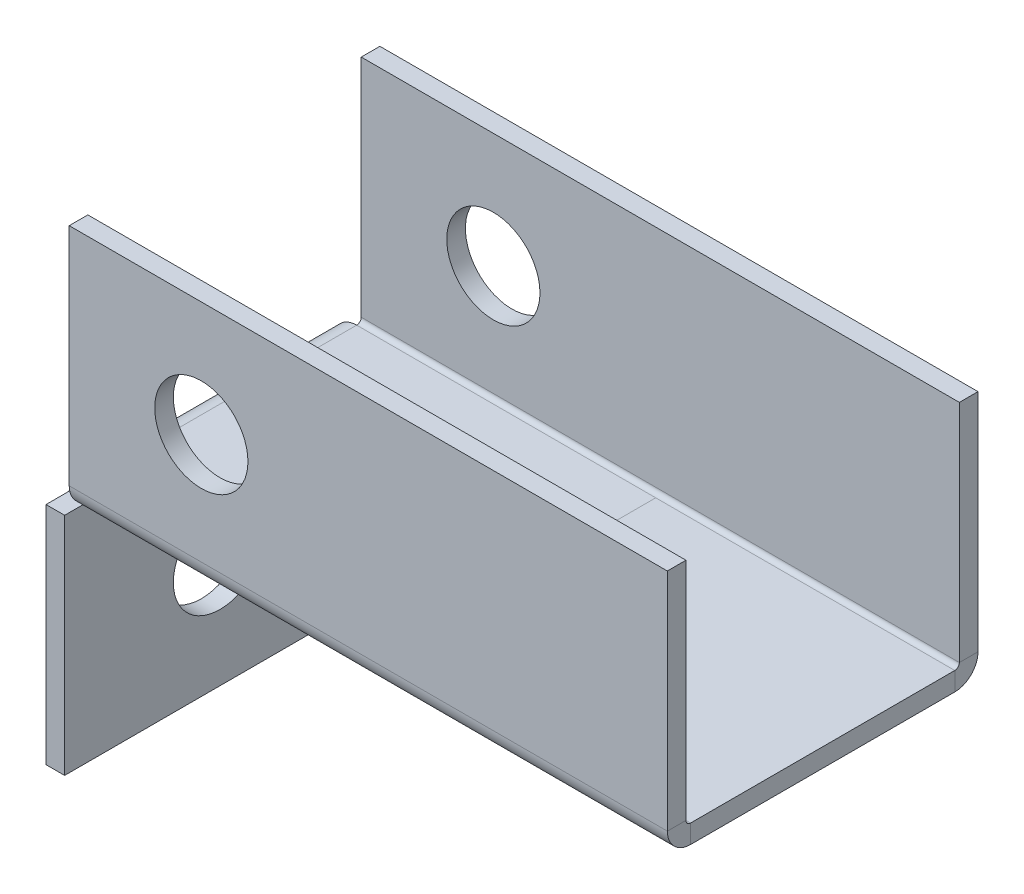
ISO-10303-21;
HEADER;
FILE_DESCRIPTION(('STEP AP214'),'2;1');
FILE_NAME('part.step','',(''),(''),'','','');
FILE_SCHEMA(('AUTOMOTIVE_DESIGN { 1 0 10303 214 1 1 1 1 }'));
ENDSEC;
DATA;
#1=APPLICATION_CONTEXT('core data for automotive mechanical design processes');
#2=APPLICATION_PROTOCOL_DEFINITION('international standard','automotive_design',2000,#1);
#3=PRODUCT_CONTEXT('',#1,'mechanical');
#4=PRODUCT('Part','Part','',(#3));
#5=PRODUCT_RELATED_PRODUCT_CATEGORY('part','',(#4));
#6=PRODUCT_DEFINITION_FORMATION('','',#4);
#7=PRODUCT_DEFINITION_CONTEXT('part definition',#1,'design');
#8=PRODUCT_DEFINITION('design','',#6,#7);
#9=PRODUCT_DEFINITION_SHAPE('','',#8);
#10=(LENGTH_UNIT() NAMED_UNIT(*) SI_UNIT(.MILLI.,.METRE.));
#11=(NAMED_UNIT(*) PLANE_ANGLE_UNIT() SI_UNIT($,.RADIAN.));
#12=(NAMED_UNIT(*) SI_UNIT($,.STERADIAN.) SOLID_ANGLE_UNIT());
#13=UNCERTAINTY_MEASURE_WITH_UNIT(LENGTH_MEASURE(1.E-05),#10,'distance_accuracy_value','');
#14=(GEOMETRIC_REPRESENTATION_CONTEXT(3) GLOBAL_UNCERTAINTY_ASSIGNED_CONTEXT((#13)) GLOBAL_UNIT_ASSIGNED_CONTEXT((#10,
#11,#12)) REPRESENTATION_CONTEXT('',''));
#15=CARTESIAN_POINT('',(0.,0.,0.));
#16=DIRECTION('',(0.,0.,1.));
#17=DIRECTION('',(1.,0.,0.));
#18=AXIS2_PLACEMENT_3D('',#15,#16,#17);
#19=CARTESIAN_POINT('',(0.,0.,0.));
#20=DIRECTION('',(0.,-1.,0.));
#21=DIRECTION('',(0.,0.,-1.));
#22=AXIS2_PLACEMENT_3D('',#19,#20,#21);
#23=PLANE('',#22);
#24=DIRECTION('',(0.,0.,1.));
#25=VECTOR('',#24,1.);
#26=CARTESIAN_POINT('',(1.8683,0.,0.));
#27=LINE('',#26,#25);
#28=CARTESIAN_POINT('',(1.8683,0.,-21.2634));
#29=VERTEX_POINT('',#28);
#30=CARTESIAN_POINT('',(1.8683,0.,21.2634));
#31=VERTEX_POINT('',#30);
#32=EDGE_CURVE('E14',#29,#31,#27,.T.);
#33=ORIENTED_EDGE('',*,*,#32,.F.);
#34=DIRECTION('',(-1.,0.,0.));
#35=VECTOR('',#34,1.);
#36=CARTESIAN_POINT('',(-46.2634,0.,-21.2634));
#37=LINE('',#36,#35);
#38=CARTESIAN_POINT('',(-46.2634,0.,-21.2634));
#39=VERTEX_POINT('',#38);
#40=EDGE_CURVE('E358',#39,#29,#37,.F.);
#41=ORIENTED_EDGE('',*,*,#40,.F.);
#42=DIRECTION('',(0.,0.,-1.));
#43=VECTOR('',#42,1.);
#44=CARTESIAN_POINT('',(-46.2634,0.,-25.));
#45=LINE('',#44,#43);
#46=CARTESIAN_POINT('',(-46.2634,0.,21.2634));
#47=VERTEX_POINT('',#46);
#48=EDGE_CURVE('E540',#39,#47,#45,.F.);
#49=ORIENTED_EDGE('',*,*,#48,.T.);
#50=DIRECTION('',(1.,0.,0.));
#51=VECTOR('',#50,1.);
#52=CARTESIAN_POINT('',(50.,0.,21.2634));
#53=LINE('',#52,#51);
#54=EDGE_CURVE('E438',#31,#47,#53,.F.);
#55=ORIENTED_EDGE('',*,*,#54,.F.);
#56=EDGE_LOOP('',(#33,#41,#49,#55));
#57=FACE_BOUND('',#56,.T.);
#58=ADVANCED_FACE('F122',(#57),#23,.F.);
#59=CARTESIAN_POINT('',(0.,-3.73660000000017,0.));
#60=DIRECTION('',(0.,-1.,0.));
#61=DIRECTION('',(1.,0.,0.));
#62=AXIS2_PLACEMENT_3D('',#59,#60,#61);
#63=PLANE('',#62);
#64=DIRECTION('',(-1.,0.,0.));
#65=VECTOR('',#64,1.);
#66=CARTESIAN_POINT('',(-47.,-3.7366,-21.2634));
#67=LINE('',#66,#65);
#68=CARTESIAN_POINT('',(-47.,-3.7366,-21.2634));
#69=VERTEX_POINT('',#68);
#70=CARTESIAN_POINT('',(-50.,-3.73659999999999,-21.2634));
#71=VERTEX_POINT('',#70);
#72=EDGE_CURVE('E130',#69,#71,#67,.T.);
#73=ORIENTED_EDGE('',*,*,#72,.F.);
#74=DIRECTION('',(0.,0.,-1.));
#75=VECTOR('',#74,1.);
#76=CARTESIAN_POINT('',(-47.,-3.7366,25.));
#77=LINE('',#76,#75);
#78=CARTESIAN_POINT('',(-47.,-3.7366,-25.));
#79=VERTEX_POINT('',#78);
#80=EDGE_CURVE('E933',#69,#79,#77,.T.);
#81=ORIENTED_EDGE('',*,*,#80,.T.);
#82=DIRECTION('',(1.,0.,0.));
#83=VECTOR('',#82,1.);
#84=CARTESIAN_POINT('',(-47.,-3.7366,-25.));
#85=LINE('',#84,#83);
#86=CARTESIAN_POINT('',(-50.,-3.73659999999999,-25.));
#87=VERTEX_POINT('',#86);
#88=EDGE_CURVE('E919',#79,#87,#85,.F.);
#89=ORIENTED_EDGE('',*,*,#88,.T.);
#90=DIRECTION('',(0.,0.,-1.));
#91=VECTOR('',#90,1.);
#92=CARTESIAN_POINT('',(-50.,-3.73659999999999,25.));
#93=LINE('',#92,#91);
#94=EDGE_CURVE('E938',#87,#71,#93,.F.);
#95=ORIENTED_EDGE('',*,*,#94,.T.);
#96=EDGE_LOOP('',(#73,#81,#89,#95));
#97=FACE_BOUND('',#96,.T.);
#98=ADVANCED_FACE('F124',(#97),#63,.F.);
#99=CARTESIAN_POINT('',(-46.2634,-3.7366,-25.));
#100=DIRECTION('',(0.,0.,-1.));
#101=DIRECTION('',(-1.,0.,0.));
#102=AXIS2_PLACEMENT_3D('',#99,#100,#101);
#103=CYLINDRICAL_SURFACE('',#102,3.73659999999999);
#104=ORIENTED_EDGE('',*,*,#48,.F.);
#105=CARTESIAN_POINT('',(-46.2634,-3.7366,-21.2634));
#106=DIRECTION('',(0.,0.,-1.));
#107=DIRECTION('',(0.,1.,0.));
#108=AXIS2_PLACEMENT_3D('',#105,#106,#107);
#109=CIRCLE('',#108,3.73659999999999);
#110=EDGE_CURVE('E544',#39,#71,#109,.F.);
#111=ORIENTED_EDGE('',*,*,#110,.T.);
#112=CARTESIAN_POINT('',(-50.,-3.73659999999999,21.2634));
#113=VERTEX_POINT('',#112);
#114=EDGE_CURVE('E944',#71,#113,#93,.F.);
#115=ORIENTED_EDGE('',*,*,#114,.T.);
#116=CARTESIAN_POINT('',(-46.2634,-3.7366,21.2634));
#117=DIRECTION('',(0.,0.,1.));
#118=DIRECTION('',(0.,-1.,0.));
#119=AXIS2_PLACEMENT_3D('',#116,#117,#118);
#120=CIRCLE('',#119,3.73659999999999);
#121=EDGE_CURVE('E547',#113,#47,#120,.F.);
#122=ORIENTED_EDGE('',*,*,#121,.T.);
#123=EDGE_LOOP('',(#104,#111,#115,#122));
#124=FACE_BOUND('',#123,.T.);
#125=ADVANCED_FACE('F519',(#124),#103,.T.);
#126=CARTESIAN_POINT('',(-46.2634,-3.7366,-21.2634));
#127=DIRECTION('',(0.,0.,-1.));
#128=DIRECTION('',(0.,1.,0.));
#129=AXIS2_PLACEMENT_3D('',#126,#127,#128);
#130=PLANE('',#129);
#131=CARTESIAN_POINT('',(-46.2634,-3.7366,-21.2634));
#132=DIRECTION('',(0.,0.,-1.));
#133=DIRECTION('',(0.,1.,0.));
#134=AXIS2_PLACEMENT_3D('',#131,#132,#133);
#135=CIRCLE('',#134,0.73659999999999);
#136=CARTESIAN_POINT('',(-46.2634,-3.00000000000002,-21.2634));
#137=VERTEX_POINT('',#136);
#138=EDGE_CURVE('E572',#137,#69,#135,.F.);
#139=ORIENTED_EDGE('',*,*,#138,.T.);
#140=ORIENTED_EDGE('',*,*,#72,.T.);
#141=ORIENTED_EDGE('',*,*,#110,.F.);
#142=DIRECTION('',(0.,-1.,0.));
#143=VECTOR('',#142,1.);
#144=CARTESIAN_POINT('',(-46.2634,0.,-21.2634));
#145=LINE('',#144,#143);
#146=EDGE_CURVE('E350',#39,#137,#145,.T.);
#147=ORIENTED_EDGE('',*,*,#146,.T.);
#148=EDGE_LOOP('',(#139,#140,#141,#147));
#149=FACE_BOUND('',#148,.T.);
#150=ADVANCED_FACE('F532',(#149),#130,.T.);
#151=CARTESIAN_POINT('',(0.,-3.,0.));
#152=DIRECTION('',(0.,-1.,0.));
#153=DIRECTION('',(0.,0.,-1.));
#154=AXIS2_PLACEMENT_3D('',#151,#152,#153);
#155=PLANE('',#154);
#156=DIRECTION('',(0.,0.,-1.));
#157=VECTOR('',#156,1.);
#158=CARTESIAN_POINT('',(-46.2634,-3.00000000000001,-25.));
#159=LINE('',#158,#157);
#160=CARTESIAN_POINT('',(-46.2634,-3.00000000000001,21.2634));
#161=VERTEX_POINT('',#160);
#162=EDGE_CURVE('E454',#137,#161,#159,.F.);
#163=ORIENTED_EDGE('',*,*,#162,.F.);
#164=DIRECTION('',(-1.,0.,0.));
#165=VECTOR('',#164,1.);
#166=CARTESIAN_POINT('',(-46.2634,-3.00000000000002,-21.2634));
#167=LINE('',#166,#165);
#168=CARTESIAN_POINT('',(50.,-3.,-21.2634));
#169=VERTEX_POINT('',#168);
#170=EDGE_CURVE('E341',#137,#169,#167,.F.);
#171=ORIENTED_EDGE('',*,*,#170,.T.);
#172=DIRECTION('',(0.,0.,-1.));
#173=VECTOR('',#172,1.);
#174=CARTESIAN_POINT('',(50.,-3.,-25.));
#175=LINE('',#174,#173);
#176=CARTESIAN_POINT('',(50.,-3.,21.2634));
#177=VERTEX_POINT('',#176);
#178=EDGE_CURVE('E553',#177,#169,#175,.T.);
#179=ORIENTED_EDGE('',*,*,#178,.F.);
#180=DIRECTION('',(1.,0.,0.));
#181=VECTOR('',#180,1.);
#182=CARTESIAN_POINT('',(50.,-3.,21.2634));
#183=LINE('',#182,#181);
#184=EDGE_CURVE('E417',#177,#161,#183,.F.);
#185=ORIENTED_EDGE('',*,*,#184,.T.);
#186=EDGE_LOOP('',(#163,#171,#179,#185));
#187=FACE_BOUND('',#186,.T.);
#188=ADVANCED_FACE('F525',(#187),#155,.T.);
#189=CARTESIAN_POINT('',(50.,0.,-21.2634));
#190=VERTEX_POINT('',#189);
#191=EDGE_CURVE('E362',#29,#190,#37,.F.);
#192=ORIENTED_EDGE('',*,*,#191,.F.);
#193=ORIENTED_EDGE('',*,*,#32,.T.);
#194=CARTESIAN_POINT('',(50.,0.,21.2634));
#195=VERTEX_POINT('',#194);
#196=EDGE_CURVE('E434',#195,#31,#53,.F.);
#197=ORIENTED_EDGE('',*,*,#196,.F.);
#198=DIRECTION('',(0.,0.,-1.));
#199=VECTOR('',#198,1.);
#200=CARTESIAN_POINT('',(50.,0.,-25.));
#201=LINE('',#200,#199);
#202=EDGE_CURVE('E536',#195,#190,#201,.T.);
#203=ORIENTED_EDGE('',*,*,#202,.T.);
#204=EDGE_LOOP('',(#192,#193,#197,#203));
#205=FACE_BOUND('',#204,.T.);
#206=ADVANCED_FACE('F515',(#205),#23,.F.);
#207=CARTESIAN_POINT('',(0.,-3.73660000000017,0.));
#208=DIRECTION('',(0.,1.,0.));
#209=DIRECTION('',(-1.,0.,0.));
#210=AXIS2_PLACEMENT_3D('',#207,#208,#209);
#211=PLANE('',#210);
#212=DIRECTION('',(1.,0.,0.));
#213=VECTOR('',#212,1.);
#214=CARTESIAN_POINT('',(-50.,-3.73659999999999,21.2634));
#215=LINE('',#214,#213);
#216=CARTESIAN_POINT('',(-47.,-3.7366,21.2634));
#217=VERTEX_POINT('',#216);
#218=EDGE_CURVE('E569',#113,#217,#215,.T.);
#219=ORIENTED_EDGE('',*,*,#218,.F.);
#220=CARTESIAN_POINT('',(-50.,-3.73659999999999,25.));
#221=VERTEX_POINT('',#220);
#222=EDGE_CURVE('E927',#113,#221,#93,.F.);
#223=ORIENTED_EDGE('',*,*,#222,.T.);
#224=DIRECTION('',(1.,0.,0.));
#225=VECTOR('',#224,1.);
#226=CARTESIAN_POINT('',(-50.,-3.73659999999999,25.));
#227=LINE('',#226,#225);
#228=CARTESIAN_POINT('',(-47.,-3.7366,25.));
#229=VERTEX_POINT('',#228);
#230=EDGE_CURVE('E446',#229,#221,#227,.F.);
#231=ORIENTED_EDGE('',*,*,#230,.F.);
#232=EDGE_CURVE('E928',#229,#217,#77,.T.);
#233=ORIENTED_EDGE('',*,*,#232,.T.);
#234=EDGE_LOOP('',(#219,#223,#231,#233));
#235=FACE_BOUND('',#234,.T.);
#236=ADVANCED_FACE('F524',(#235),#211,.T.);
#237=CARTESIAN_POINT('',(50.,-3.,-25.));
#238=DIRECTION('',(1.,0.,0.));
#239=DIRECTION('',(0.,0.,-1.));
#240=AXIS2_PLACEMENT_3D('',#237,#238,#239);
#241=PLANE('',#240);
#242=DIRECTION('',(0.,-1.,0.));
#243=VECTOR('',#242,1.);
#244=CARTESIAN_POINT('',(50.,0.,-21.2634));
#245=LINE('',#244,#243);
#246=EDGE_CURVE('E367',#190,#169,#245,.T.);
#247=ORIENTED_EDGE('',*,*,#246,.F.);
#248=ORIENTED_EDGE('',*,*,#202,.F.);
#249=DIRECTION('',(0.,-1.,0.));
#250=VECTOR('',#249,1.);
#251=CARTESIAN_POINT('',(50.,0.,21.2634));
#252=LINE('',#251,#250);
#253=EDGE_CURVE('E426',#195,#177,#252,.T.);
#254=ORIENTED_EDGE('',*,*,#253,.T.);
#255=ORIENTED_EDGE('',*,*,#178,.T.);
#256=EDGE_LOOP('',(#247,#248,#254,#255));
#257=FACE_BOUND('',#256,.T.);
#258=ADVANCED_FACE('F529',(#257),#241,.T.);
#259=CARTESIAN_POINT('',(-46.2634,-3.7366,21.2634));
#260=DIRECTION('',(0.,0.,1.));
#261=DIRECTION('',(0.,-1.,0.));
#262=AXIS2_PLACEMENT_3D('',#259,#260,#261);
#263=PLANE('',#262);
#264=ORIENTED_EDGE('',*,*,#121,.F.);
#265=ORIENTED_EDGE('',*,*,#218,.T.);
#266=CARTESIAN_POINT('',(-46.2634,-3.7366,21.2634));
#267=DIRECTION('',(0.,0.,1.));
#268=DIRECTION('',(0.,-1.,0.));
#269=AXIS2_PLACEMENT_3D('',#266,#267,#268);
#270=CIRCLE('',#269,0.73659999999999);
#271=EDGE_CURVE('E565',#217,#161,#270,.F.);
#272=ORIENTED_EDGE('',*,*,#271,.T.);
#273=DIRECTION('',(0.,-1.,0.));
#274=VECTOR('',#273,1.);
#275=CARTESIAN_POINT('',(-46.2634,0.,21.2634));
#276=LINE('',#275,#274);
#277=EDGE_CURVE('E442',#47,#161,#276,.T.);
#278=ORIENTED_EDGE('',*,*,#277,.F.);
#279=EDGE_LOOP('',(#264,#265,#272,#278));
#280=FACE_BOUND('',#279,.T.);
#281=ADVANCED_FACE('F628',(#280),#263,.T.);
#282=CARTESIAN_POINT('',(-46.2634,-3.7366,-25.));
#283=DIRECTION('',(0.,0.,-1.));
#284=DIRECTION('',(-1.,0.,0.));
#285=AXIS2_PLACEMENT_3D('',#282,#283,#284);
#286=CYLINDRICAL_SURFACE('',#285,0.73659999999999);
#287=ORIENTED_EDGE('',*,*,#138,.F.);
#288=ORIENTED_EDGE('',*,*,#162,.T.);
#289=ORIENTED_EDGE('',*,*,#271,.F.);
#290=EDGE_CURVE('E948',#217,#69,#77,.T.);
#291=ORIENTED_EDGE('',*,*,#290,.T.);
#292=EDGE_LOOP('',(#287,#288,#289,#291));
#293=FACE_BOUND('',#292,.T.);
#294=ADVANCED_FACE('F668',(#293),#286,.F.);
#295=CARTESIAN_POINT('',(-50.0000000000001,-40.,-25.));
#296=DIRECTION('',(0.,0.,1.));
#297=DIRECTION('',(1.,0.,0.));
#298=AXIS2_PLACEMENT_3D('',#295,#296,#297);
#299=PLANE('',#298);
#300=ORIENTED_EDGE('',*,*,#88,.F.);
#301=DIRECTION('',(0.,1.,0.));
#302=VECTOR('',#301,1.);
#303=CARTESIAN_POINT('',(-47.0000000000001,-40.,-25.));
#304=LINE('',#303,#302);
#305=CARTESIAN_POINT('',(-47.0000000000001,-40.,-25.));
#306=VERTEX_POINT('',#305);
#307=EDGE_CURVE('E922',#79,#306,#304,.F.);
#308=ORIENTED_EDGE('',*,*,#307,.T.);
#309=DIRECTION('',(1.,0.,0.));
#310=VECTOR('',#309,1.);
#311=CARTESIAN_POINT('',(-50.0000000000001,-40.,-25.));
#312=LINE('',#311,#310);
#313=CARTESIAN_POINT('',(-50.0000000000001,-40.,-25.));
#314=VERTEX_POINT('',#313);
#315=EDGE_CURVE('E450',#314,#306,#312,.T.);
#316=ORIENTED_EDGE('',*,*,#315,.F.);
#317=DIRECTION('',(0.,-1.,0.));
#318=VECTOR('',#317,1.);
#319=CARTESIAN_POINT('',(-50.,1.90979454354656E-13,-25.));
#320=LINE('',#319,#318);
#321=EDGE_CURVE('E467',#87,#314,#320,.T.);
#322=ORIENTED_EDGE('',*,*,#321,.F.);
#323=EDGE_LOOP('',(#300,#308,#316,#322));
#324=FACE_BOUND('',#323,.T.);
#325=ADVANCED_FACE('F736',(#324),#299,.F.);
#326=CARTESIAN_POINT('',(-50.,-2.99999999999999,25.));
#327=DIRECTION('',(0.,0.,-1.));
#328=DIRECTION('',(-1.,0.,0.));
#329=AXIS2_PLACEMENT_3D('',#326,#327,#328);
#330=PLANE('',#329);
#331=ORIENTED_EDGE('',*,*,#230,.T.);
#332=DIRECTION('',(0.,1.,0.));
#333=VECTOR('',#332,1.);
#334=CARTESIAN_POINT('',(-50.,1.86291012527692E-13,25.));
#335=LINE('',#334,#333);
#336=CARTESIAN_POINT('',(-50.0000000000001,-40.,25.));
#337=VERTEX_POINT('',#336);
#338=EDGE_CURVE('E459',#337,#221,#335,.T.);
#339=ORIENTED_EDGE('',*,*,#338,.F.);
#340=DIRECTION('',(1.,0.,0.));
#341=VECTOR('',#340,1.);
#342=CARTESIAN_POINT('',(-50.0000000000001,-40.,25.));
#343=LINE('',#342,#341);
#344=CARTESIAN_POINT('',(-47.0000000000001,-40.,25.));
#345=VERTEX_POINT('',#344);
#346=EDGE_CURVE('E455',#337,#345,#343,.T.);
#347=ORIENTED_EDGE('',*,*,#346,.T.);
#348=DIRECTION('',(0.,-1.,0.));
#349=VECTOR('',#348,1.);
#350=CARTESIAN_POINT('',(-47.,-3.,25.));
#351=LINE('',#350,#349);
#352=EDGE_CURVE('E942',#345,#229,#351,.F.);
#353=ORIENTED_EDGE('',*,*,#352,.T.);
#354=EDGE_LOOP('',(#331,#339,#347,#353));
#355=FACE_BOUND('',#354,.T.);
#356=ADVANCED_FACE('F612',(#355),#330,.F.);
#357=CARTESIAN_POINT('',(-50.,1.88635233441174E-13,0.));
#358=DIRECTION('',(1.,0.,0.));
#359=DIRECTION('',(0.,1.,0.));
#360=AXIS2_PLACEMENT_3D('',#357,#358,#359);
#361=PLANE('',#360);
#362=CARTESIAN_POINT('',(-50.,-21.8683,0.));
#363=DIRECTION('',(-1.,0.,0.));
#364=DIRECTION('',(0.,-1.,0.));
#365=AXIS2_PLACEMENT_3D('',#362,#363,#364);
#366=CIRCLE('',#365,7.5);
#367=CARTESIAN_POINT('',(-50.0000000000001,-29.3683,0.));
#368=VERTEX_POINT('',#367);
#369=EDGE_CURVE('E481',#368,#368,#366,.T.);
#370=ORIENTED_EDGE('',*,*,#369,.F.);
#371=EDGE_LOOP('',(#370));
#372=FACE_BOUND('',#371,.T.);
#373=ORIENTED_EDGE('',*,*,#94,.F.);
#374=ORIENTED_EDGE('',*,*,#321,.T.);
#375=DIRECTION('',(0.,0.,1.));
#376=VECTOR('',#375,1.);
#377=CARTESIAN_POINT('',(-50.0000000000001,-40.,0.));
#378=LINE('',#377,#376);
#379=EDGE_CURVE('E463',#314,#337,#378,.T.);
#380=ORIENTED_EDGE('',*,*,#379,.T.);
#381=ORIENTED_EDGE('',*,*,#338,.T.);
#382=ORIENTED_EDGE('',*,*,#222,.F.);
#383=ORIENTED_EDGE('',*,*,#114,.F.);
#384=EDGE_LOOP('',(#373,#374,#380,#381,#382,#383));
#385=FACE_BOUND('',#384,.T.);
#386=ADVANCED_FACE('F608',(#372,#385),#361,.F.);
#387=CARTESIAN_POINT('',(-47.,1.78160789424645E-13,0.));
#388=DIRECTION('',(1.,0.,0.));
#389=DIRECTION('',(0.,1.,0.));
#390=AXIS2_PLACEMENT_3D('',#387,#388,#389);
#391=PLANE('',#390);
#392=CARTESIAN_POINT('',(-47.,-21.8683,0.));
#393=DIRECTION('',(1.,0.,0.));
#394=DIRECTION('',(0.,1.,0.));
#395=AXIS2_PLACEMENT_3D('',#392,#393,#394);
#396=CIRCLE('',#395,7.5);
#397=CARTESIAN_POINT('',(-47.,-14.3683,0.));
#398=VERTEX_POINT('',#397);
#399=EDGE_CURVE('E1015',#398,#398,#396,.F.);
#400=ORIENTED_EDGE('',*,*,#399,.T.);
#401=EDGE_LOOP('',(#400));
#402=FACE_BOUND('',#401,.T.);
#403=ORIENTED_EDGE('',*,*,#307,.F.);
#404=ORIENTED_EDGE('',*,*,#80,.F.);
#405=ORIENTED_EDGE('',*,*,#290,.F.);
#406=ORIENTED_EDGE('',*,*,#232,.F.);
#407=ORIENTED_EDGE('',*,*,#352,.F.);
#408=DIRECTION('',(0.,0.,-1.));
#409=VECTOR('',#408,1.);
#410=CARTESIAN_POINT('',(-47.0000000000001,-40.,25.));
#411=LINE('',#410,#409);
#412=EDGE_CURVE('E936',#306,#345,#411,.F.);
#413=ORIENTED_EDGE('',*,*,#412,.F.);
#414=EDGE_LOOP('',(#403,#404,#405,#406,#407,#413));
#415=FACE_BOUND('',#414,.T.);
#416=ADVANCED_FACE('F611',(#402,#415),#391,.T.);
#417=CARTESIAN_POINT('',(-50.0000000000001,-40.,25.));
#418=DIRECTION('',(0.,1.,0.));
#419=DIRECTION('',(-1.,0.,0.));
#420=AXIS2_PLACEMENT_3D('',#417,#418,#419);
#421=PLANE('',#420);
#422=ORIENTED_EDGE('',*,*,#412,.T.);
#423=ORIENTED_EDGE('',*,*,#346,.F.);
#424=ORIENTED_EDGE('',*,*,#379,.F.);
#425=ORIENTED_EDGE('',*,*,#315,.T.);
#426=EDGE_LOOP('',(#422,#423,#424,#425));
#427=FACE_BOUND('',#426,.T.);
#428=ADVANCED_FACE('F620',(#427),#421,.F.);
#429=CARTESIAN_POINT('',(-46.2634,0.736599999999997,21.2634));
#430=DIRECTION('',(-1.,0.,0.));
#431=DIRECTION('',(0.,0.,1.));
#432=AXIS2_PLACEMENT_3D('',#429,#430,#431);
#433=PLANE('',#432);
#434=DIRECTION('',(0.,0.,-1.));
#435=VECTOR('',#434,1.);
#436=CARTESIAN_POINT('',(-46.2634,0.736599999999997,25.));
#437=LINE('',#436,#435);
#438=CARTESIAN_POINT('',(-46.2634,0.736599999999997,22.));
#439=VERTEX_POINT('',#438);
#440=CARTESIAN_POINT('',(-46.2634,0.736599999999997,25.));
#441=VERTEX_POINT('',#440);
#442=EDGE_CURVE('E371',#439,#441,#437,.F.);
#443=ORIENTED_EDGE('',*,*,#442,.F.);
#444=CARTESIAN_POINT('',(-46.2634,0.736599999999997,21.2634));
#445=DIRECTION('',(1.,0.,0.));
#446=DIRECTION('',(0.,0.,-1.));
#447=AXIS2_PLACEMENT_3D('',#444,#445,#446);
#448=CIRCLE('',#447,0.7366);
#449=EDGE_CURVE('E430',#47,#439,#448,.F.);
#450=ORIENTED_EDGE('',*,*,#449,.F.);
#451=ORIENTED_EDGE('',*,*,#277,.T.);
#452=CARTESIAN_POINT('',(-46.2634,0.736599999999997,21.2634));
#453=DIRECTION('',(1.,0.,0.));
#454=DIRECTION('',(0.,0.,-1.));
#455=AXIS2_PLACEMENT_3D('',#452,#453,#454);
#456=CIRCLE('',#455,3.7366);
#457=EDGE_CURVE('E421',#161,#441,#456,.F.);
#458=ORIENTED_EDGE('',*,*,#457,.T.);
#459=EDGE_LOOP('',(#443,#450,#451,#458));
#460=FACE_BOUND('',#459,.T.);
#461=ADVANCED_FACE('F634',(#460),#433,.T.);
#462=CARTESIAN_POINT('',(50.,0.736599999999997,21.2634));
#463=DIRECTION('',(-1.,0.,0.));
#464=DIRECTION('',(0.,0.,1.));
#465=AXIS2_PLACEMENT_3D('',#462,#463,#464);
#466=PLANE('',#465);
#467=CARTESIAN_POINT('',(50.,0.736599999999997,21.2634));
#468=DIRECTION('',(1.,0.,0.));
#469=DIRECTION('',(0.,0.,-1.));
#470=AXIS2_PLACEMENT_3D('',#467,#468,#469);
#471=CIRCLE('',#470,0.7366);
#472=CARTESIAN_POINT('',(50.,0.736599999999997,22.));
#473=VERTEX_POINT('',#472);
#474=EDGE_CURVE('E379',#473,#195,#471,.T.);
#475=ORIENTED_EDGE('',*,*,#474,.F.);
#476=DIRECTION('',(0.,0.,-1.));
#477=VECTOR('',#476,1.);
#478=CARTESIAN_POINT('',(50.,0.736599999999997,22.));
#479=LINE('',#478,#477);
#480=CARTESIAN_POINT('',(50.,0.736599999999997,25.));
#481=VERTEX_POINT('',#480);
#482=EDGE_CURVE('E407',#473,#481,#479,.F.);
#483=ORIENTED_EDGE('',*,*,#482,.T.);
#484=CARTESIAN_POINT('',(50.,0.736599999999997,21.2634));
#485=DIRECTION('',(1.,0.,0.));
#486=DIRECTION('',(0.,0.,-1.));
#487=AXIS2_PLACEMENT_3D('',#484,#485,#486);
#488=CIRCLE('',#487,3.7366);
#489=EDGE_CURVE('E422',#481,#177,#488,.T.);
#490=ORIENTED_EDGE('',*,*,#489,.T.);
#491=ORIENTED_EDGE('',*,*,#253,.F.);
#492=EDGE_LOOP('',(#475,#483,#490,#491));
#493=FACE_BOUND('',#492,.T.);
#494=ADVANCED_FACE('F637',(#493),#466,.F.);
#495=CARTESIAN_POINT('',(50.,0.736599999999997,21.2634));
#496=DIRECTION('',(1.,0.,0.));
#497=DIRECTION('',(0.,0.,1.));
#498=AXIS2_PLACEMENT_3D('',#495,#496,#497);
#499=CYLINDRICAL_SURFACE('',#498,3.7366);
#500=ORIENTED_EDGE('',*,*,#184,.F.);
#501=ORIENTED_EDGE('',*,*,#489,.F.);
#502=DIRECTION('',(1.,0.,0.));
#503=VECTOR('',#502,1.);
#504=CARTESIAN_POINT('',(-46.2634,0.736599999999997,25.));
#505=LINE('',#504,#503);
#506=EDGE_CURVE('E404',#481,#441,#505,.F.);
#507=ORIENTED_EDGE('',*,*,#506,.T.);
#508=ORIENTED_EDGE('',*,*,#457,.F.);
#509=EDGE_LOOP('',(#500,#501,#507,#508));
#510=FACE_BOUND('',#509,.T.);
#511=ADVANCED_FACE('F645',(#510),#499,.T.);
#512=CARTESIAN_POINT('',(50.,0.736599999999997,21.2634));
#513=DIRECTION('',(1.,0.,0.));
#514=DIRECTION('',(0.,0.,1.));
#515=AXIS2_PLACEMENT_3D('',#512,#513,#514);
#516=CYLINDRICAL_SURFACE('',#515,0.7366);
#517=ORIENTED_EDGE('',*,*,#196,.T.);
#518=ORIENTED_EDGE('',*,*,#54,.T.);
#519=ORIENTED_EDGE('',*,*,#449,.T.);
#520=DIRECTION('',(1.,0.,0.));
#521=VECTOR('',#520,1.);
#522=CARTESIAN_POINT('',(-46.2634,0.736599999999997,22.));
#523=LINE('',#522,#521);
#524=EDGE_CURVE('E411',#439,#473,#523,.T.);
#525=ORIENTED_EDGE('',*,*,#524,.T.);
#526=ORIENTED_EDGE('',*,*,#474,.T.);
#527=EDGE_LOOP('',(#517,#518,#519,#525,#526));
#528=FACE_BOUND('',#527,.T.);
#529=ADVANCED_FACE('F697',(#528),#516,.F.);
#530=CARTESIAN_POINT('',(50.,37.,25.));
#531=DIRECTION('',(-1.,0.,0.));
#532=DIRECTION('',(0.,0.,1.));
#533=AXIS2_PLACEMENT_3D('',#530,#531,#532);
#534=PLANE('',#533);
#535=ORIENTED_EDGE('',*,*,#482,.F.);
#536=DIRECTION('',(0.,-1.,0.));
#537=VECTOR('',#536,1.);
#538=CARTESIAN_POINT('',(50.,37.,22.));
#539=LINE('',#538,#537);
#540=CARTESIAN_POINT('',(50.,37.,22.));
#541=VERTEX_POINT('',#540);
#542=EDGE_CURVE('E401',#473,#541,#539,.F.);
#543=ORIENTED_EDGE('',*,*,#542,.T.);
#544=DIRECTION('',(0.,0.,-1.));
#545=VECTOR('',#544,1.);
#546=CARTESIAN_POINT('',(50.,37.,25.));
#547=LINE('',#546,#545);
#548=CARTESIAN_POINT('',(50.,37.,25.));
#549=VERTEX_POINT('',#548);
#550=EDGE_CURVE('E375',#549,#541,#547,.T.);
#551=ORIENTED_EDGE('',*,*,#550,.F.);
#552=DIRECTION('',(0.,1.,0.));
#553=VECTOR('',#552,1.);
#554=CARTESIAN_POINT('',(50.,0.,25.));
#555=LINE('',#554,#553);
#556=EDGE_CURVE('E391',#481,#549,#555,.T.);
#557=ORIENTED_EDGE('',*,*,#556,.F.);
#558=EDGE_LOOP('',(#535,#543,#551,#557));
#559=FACE_BOUND('',#558,.T.);
#560=ADVANCED_FACE('F691',(#559),#534,.F.);
#561=CARTESIAN_POINT('',(-46.2634,0.,25.));
#562=DIRECTION('',(1.,0.,0.));
#563=DIRECTION('',(0.,0.,-1.));
#564=AXIS2_PLACEMENT_3D('',#561,#562,#563);
#565=PLANE('',#564);
#566=ORIENTED_EDGE('',*,*,#442,.T.);
#567=DIRECTION('',(0.,-1.,0.));
#568=VECTOR('',#567,1.);
#569=CARTESIAN_POINT('',(-46.2634,0.,25.));
#570=LINE('',#569,#568);
#571=CARTESIAN_POINT('',(-46.2634,37.,25.));
#572=VERTEX_POINT('',#571);
#573=EDGE_CURVE('E384',#572,#441,#570,.T.);
#574=ORIENTED_EDGE('',*,*,#573,.F.);
#575=DIRECTION('',(0.,0.,-1.));
#576=VECTOR('',#575,1.);
#577=CARTESIAN_POINT('',(-46.2634,37.,25.));
#578=LINE('',#577,#576);
#579=CARTESIAN_POINT('',(-46.2634,37.,22.));
#580=VERTEX_POINT('',#579);
#581=EDGE_CURVE('E380',#572,#580,#578,.T.);
#582=ORIENTED_EDGE('',*,*,#581,.T.);
#583=DIRECTION('',(0.,1.,0.));
#584=VECTOR('',#583,1.);
#585=CARTESIAN_POINT('',(-46.2634,0.,22.));
#586=LINE('',#585,#584);
#587=EDGE_CURVE('E394',#580,#439,#586,.F.);
#588=ORIENTED_EDGE('',*,*,#587,.T.);
#589=EDGE_LOOP('',(#566,#574,#582,#588));
#590=FACE_BOUND('',#589,.T.);
#591=ADVANCED_FACE('F689',(#590),#565,.F.);
#592=CARTESIAN_POINT('',(0.,0.,25.));
#593=DIRECTION('',(0.,0.,-1.));
#594=DIRECTION('',(-1.,0.,0.));
#595=AXIS2_PLACEMENT_3D('',#592,#593,#594);
#596=PLANE('',#595);
#597=CARTESIAN_POINT('',(-25.,18.5,25.));
#598=DIRECTION('',(0.,0.,1.));
#599=DIRECTION('',(1.,0.,0.));
#600=AXIS2_PLACEMENT_3D('',#597,#598,#599);
#601=CIRCLE('',#600,7.5);
#602=CARTESIAN_POINT('',(-17.5,18.5,25.));
#603=VERTEX_POINT('',#602);
#604=EDGE_CURVE('E475',#603,#603,#601,.T.);
#605=ORIENTED_EDGE('',*,*,#604,.F.);
#606=EDGE_LOOP('',(#605));
#607=FACE_BOUND('',#606,.T.);
#608=ORIENTED_EDGE('',*,*,#506,.F.);
#609=ORIENTED_EDGE('',*,*,#556,.T.);
#610=DIRECTION('',(-1.,0.,0.));
#611=VECTOR('',#610,1.);
#612=CARTESIAN_POINT('',(0.,37.,25.));
#613=LINE('',#612,#611);
#614=EDGE_CURVE('E388',#549,#572,#613,.T.);
#615=ORIENTED_EDGE('',*,*,#614,.T.);
#616=ORIENTED_EDGE('',*,*,#573,.T.);
#617=EDGE_LOOP('',(#608,#609,#615,#616));
#618=FACE_BOUND('',#617,.T.);
#619=ADVANCED_FACE('F690',(#607,#618),#596,.F.);
#620=CARTESIAN_POINT('',(0.,0.,22.));
#621=DIRECTION('',(0.,0.,-1.));
#622=DIRECTION('',(-1.,0.,0.));
#623=AXIS2_PLACEMENT_3D('',#620,#621,#622);
#624=PLANE('',#623);
#625=CARTESIAN_POINT('',(-25.,18.5,22.));
#626=DIRECTION('',(0.,0.,-1.));
#627=DIRECTION('',(-1.,0.,0.));
#628=AXIS2_PLACEMENT_3D('',#625,#626,#627);
#629=CIRCLE('',#628,7.5);
#630=CARTESIAN_POINT('',(-32.5,18.5,22.));
#631=VERTEX_POINT('',#630);
#632=EDGE_CURVE('E340',#631,#631,#629,.T.);
#633=ORIENTED_EDGE('',*,*,#632,.F.);
#634=EDGE_LOOP('',(#633));
#635=FACE_BOUND('',#634,.T.);
#636=ORIENTED_EDGE('',*,*,#542,.F.);
#637=ORIENTED_EDGE('',*,*,#524,.F.);
#638=ORIENTED_EDGE('',*,*,#587,.F.);
#639=DIRECTION('',(1.,0.,0.));
#640=VECTOR('',#639,1.);
#641=CARTESIAN_POINT('',(-46.2634,37.,22.));
#642=LINE('',#641,#640);
#643=EDGE_CURVE('E398',#541,#580,#642,.F.);
#644=ORIENTED_EDGE('',*,*,#643,.F.);
#645=EDGE_LOOP('',(#636,#637,#638,#644));
#646=FACE_BOUND('',#645,.T.);
#647=ADVANCED_FACE('F683',(#635,#646),#624,.T.);
#648=CARTESIAN_POINT('',(-46.2634,37.,25.));
#649=DIRECTION('',(0.,-1.,0.));
#650=DIRECTION('',(0.,0.,-1.));
#651=AXIS2_PLACEMENT_3D('',#648,#649,#650);
#652=PLANE('',#651);
#653=ORIENTED_EDGE('',*,*,#643,.T.);
#654=ORIENTED_EDGE('',*,*,#581,.F.);
#655=ORIENTED_EDGE('',*,*,#614,.F.);
#656=ORIENTED_EDGE('',*,*,#550,.T.);
#657=EDGE_LOOP('',(#653,#654,#655,#656));
#658=FACE_BOUND('',#657,.T.);
#659=ADVANCED_FACE('F654',(#658),#652,.F.);
#660=CARTESIAN_POINT('',(50.,0.736599999999994,-21.2634));
#661=DIRECTION('',(1.,0.,0.));
#662=DIRECTION('',(0.,1.,0.));
#663=AXIS2_PLACEMENT_3D('',#660,#661,#662);
#664=PLANE('',#663);
#665=DIRECTION('',(0.,0.,1.));
#666=VECTOR('',#665,1.);
#667=CARTESIAN_POINT('',(50.,0.736600000000018,-25.));
#668=LINE('',#667,#666);
#669=CARTESIAN_POINT('',(50.,0.736599999999991,-22.));
#670=VERTEX_POINT('',#669);
#671=CARTESIAN_POINT('',(50.,0.73659999999998,-25.));
#672=VERTEX_POINT('',#671);
#673=EDGE_CURVE('E314',#670,#672,#668,.F.);
#674=ORIENTED_EDGE('',*,*,#673,.F.);
#675=CARTESIAN_POINT('',(50.,0.736599999999994,-21.2634));
#676=DIRECTION('',(-1.,0.,0.));
#677=DIRECTION('',(0.,-1.,0.));
#678=AXIS2_PLACEMENT_3D('',#675,#676,#677);
#679=CIRCLE('',#678,0.736600000000004);
#680=EDGE_CURVE('E354',#190,#670,#679,.F.);
#681=ORIENTED_EDGE('',*,*,#680,.F.);
#682=ORIENTED_EDGE('',*,*,#246,.T.);
#683=CARTESIAN_POINT('',(50.,0.736599999999994,-21.2634));
#684=DIRECTION('',(-1.,0.,0.));
#685=DIRECTION('',(0.,-1.,0.));
#686=AXIS2_PLACEMENT_3D('',#683,#684,#685);
#687=CIRCLE('',#686,3.7366);
#688=EDGE_CURVE('E345',#169,#672,#687,.F.);
#689=ORIENTED_EDGE('',*,*,#688,.T.);
#690=EDGE_LOOP('',(#674,#681,#682,#689));
#691=FACE_BOUND('',#690,.T.);
#692=ADVANCED_FACE('F651',(#691),#664,.T.);
#693=CARTESIAN_POINT('',(-46.2634,0.736599999999987,-21.2634));
#694=DIRECTION('',(1.,0.,0.));
#695=DIRECTION('',(0.,1.,0.));
#696=AXIS2_PLACEMENT_3D('',#693,#694,#695);
#697=PLANE('',#696);
#698=CARTESIAN_POINT('',(-46.2634,0.736599999999987,-21.2634));
#699=DIRECTION('',(-1.,0.,0.));
#700=DIRECTION('',(0.,-1.,0.));
#701=AXIS2_PLACEMENT_3D('',#698,#699,#700);
#702=CIRCLE('',#701,0.736600000000004);
#703=CARTESIAN_POINT('',(-46.2634,0.736599999999984,-22.));
#704=VERTEX_POINT('',#703);
#705=EDGE_CURVE('E363',#704,#39,#702,.T.);
#706=ORIENTED_EDGE('',*,*,#705,.F.);
#707=DIRECTION('',(0.,0.,1.));
#708=VECTOR('',#707,1.);
#709=CARTESIAN_POINT('',(-46.2634,0.736599999999993,-22.));
#710=LINE('',#709,#708);
#711=CARTESIAN_POINT('',(-46.2634,0.736600000000014,-25.));
#712=VERTEX_POINT('',#711);
#713=EDGE_CURVE('E331',#704,#712,#710,.F.);
#714=ORIENTED_EDGE('',*,*,#713,.T.);
#715=CARTESIAN_POINT('',(-46.2634,0.736599999999987,-21.2634));
#716=DIRECTION('',(-1.,0.,0.));
#717=DIRECTION('',(0.,-1.,0.));
#718=AXIS2_PLACEMENT_3D('',#715,#716,#717);
#719=CIRCLE('',#718,3.7366);
#720=EDGE_CURVE('E346',#712,#137,#719,.T.);
#721=ORIENTED_EDGE('',*,*,#720,.T.);
#722=ORIENTED_EDGE('',*,*,#146,.F.);
#723=EDGE_LOOP('',(#706,#714,#721,#722));
#724=FACE_BOUND('',#723,.T.);
#725=ADVANCED_FACE('F501',(#724),#697,.F.);
#726=CARTESIAN_POINT('',(-46.2634,0.736599999999987,-21.2634));
#727=DIRECTION('',(-1.,0.,0.));
#728=DIRECTION('',(0.,0.,-1.));
#729=AXIS2_PLACEMENT_3D('',#726,#727,#728);
#730=CYLINDRICAL_SURFACE('',#729,3.7366);
#731=ORIENTED_EDGE('',*,*,#170,.F.);
#732=ORIENTED_EDGE('',*,*,#720,.F.);
#733=DIRECTION('',(-1.,0.,0.));
#734=VECTOR('',#733,1.);
#735=CARTESIAN_POINT('',(50.,0.736600000000018,-25.));
#736=LINE('',#735,#734);
#737=EDGE_CURVE('E328',#712,#672,#736,.F.);
#738=ORIENTED_EDGE('',*,*,#737,.T.);
#739=ORIENTED_EDGE('',*,*,#688,.F.);
#740=EDGE_LOOP('',(#731,#732,#738,#739));
#741=FACE_BOUND('',#740,.T.);
#742=ADVANCED_FACE('F662',(#741),#730,.T.);
#743=CARTESIAN_POINT('',(-46.2634,0.736599999999987,-21.2634));
#744=DIRECTION('',(-1.,0.,0.));
#745=DIRECTION('',(0.,0.,-1.));
#746=AXIS2_PLACEMENT_3D('',#743,#744,#745);
#747=CYLINDRICAL_SURFACE('',#746,0.736600000000004);
#748=ORIENTED_EDGE('',*,*,#40,.T.);
#749=ORIENTED_EDGE('',*,*,#191,.T.);
#750=ORIENTED_EDGE('',*,*,#680,.T.);
#751=DIRECTION('',(-1.,0.,0.));
#752=VECTOR('',#751,1.);
#753=CARTESIAN_POINT('',(50.,0.736599999999997,-22.));
#754=LINE('',#753,#752);
#755=EDGE_CURVE('E335',#670,#704,#754,.T.);
#756=ORIENTED_EDGE('',*,*,#755,.T.);
#757=ORIENTED_EDGE('',*,*,#705,.T.);
#758=EDGE_LOOP('',(#748,#749,#750,#756,#757));
#759=FACE_BOUND('',#758,.T.);
#760=ADVANCED_FACE('F496',(#759),#747,.F.);
#761=CARTESIAN_POINT('',(50.,0.,-25.));
#762=DIRECTION('',(-1.,0.,0.));
#763=DIRECTION('',(0.,-1.,0.));
#764=AXIS2_PLACEMENT_3D('',#761,#762,#763);
#765=PLANE('',#764);
#766=ORIENTED_EDGE('',*,*,#673,.T.);
#767=DIRECTION('',(0.,-1.,0.));
#768=VECTOR('',#767,1.);
#769=CARTESIAN_POINT('',(50.,0.,-25.));
#770=LINE('',#769,#768);
#771=CARTESIAN_POINT('',(50.,37.,-25.0000000000001));
#772=VERTEX_POINT('',#771);
#773=EDGE_CURVE('E293',#772,#672,#770,.T.);
#774=ORIENTED_EDGE('',*,*,#773,.F.);
#775=DIRECTION('',(0.,0.,1.));
#776=VECTOR('',#775,1.);
#777=CARTESIAN_POINT('',(50.,37.,-25.0000000000001));
#778=LINE('',#777,#776);
#779=CARTESIAN_POINT('',(50.,37.,-22.0000000000001));
#780=VERTEX_POINT('',#779);
#781=EDGE_CURVE('E300',#772,#780,#778,.T.);
#782=ORIENTED_EDGE('',*,*,#781,.T.);
#783=DIRECTION('',(0.,1.,0.));
#784=VECTOR('',#783,1.);
#785=CARTESIAN_POINT('',(50.,0.,-22.));
#786=LINE('',#785,#784);
#787=EDGE_CURVE('E325',#780,#670,#786,.F.);
#788=ORIENTED_EDGE('',*,*,#787,.T.);
#789=EDGE_LOOP('',(#766,#774,#782,#788));
#790=FACE_BOUND('',#789,.T.);
#791=ADVANCED_FACE('F313',(#790),#765,.F.);
#792=CARTESIAN_POINT('',(-46.2634,37.,-25.0000000000001));
#793=DIRECTION('',(1.,0.,0.));
#794=DIRECTION('',(0.,1.,0.));
#795=AXIS2_PLACEMENT_3D('',#792,#793,#794);
#796=PLANE('',#795);
#797=ORIENTED_EDGE('',*,*,#713,.F.);
#798=DIRECTION('',(0.,-1.,0.));
#799=VECTOR('',#798,1.);
#800=CARTESIAN_POINT('',(-46.2634,37.,-22.0000000000001));
#801=LINE('',#800,#799);
#802=CARTESIAN_POINT('',(-46.2634,37.,-22.0000000000001));
#803=VERTEX_POINT('',#802);
#804=EDGE_CURVE('E320',#704,#803,#801,.F.);
#805=ORIENTED_EDGE('',*,*,#804,.T.);
#806=DIRECTION('',(0.,0.,1.));
#807=VECTOR('',#806,1.);
#808=CARTESIAN_POINT('',(-46.2634,37.,-25.0000000000001));
#809=LINE('',#808,#807);
#810=CARTESIAN_POINT('',(-46.2634,37.,-25.0000000000001));
#811=VERTEX_POINT('',#810);
#812=EDGE_CURVE('E310',#811,#803,#809,.T.);
#813=ORIENTED_EDGE('',*,*,#812,.F.);
#814=DIRECTION('',(0.,1.,0.));
#815=VECTOR('',#814,1.);
#816=CARTESIAN_POINT('',(-46.2634,-1.05886748200073E-13,-25.));
#817=LINE('',#816,#815);
#818=EDGE_CURVE('E295',#712,#811,#817,.T.);
#819=ORIENTED_EDGE('',*,*,#818,.F.);
#820=EDGE_LOOP('',(#797,#805,#813,#819));
#821=FACE_BOUND('',#820,.T.);
#822=ADVANCED_FACE('F502',(#821),#796,.F.);
#823=CARTESIAN_POINT('',(0.,0.,-25.));
#824=DIRECTION('',(0.,0.,1.));
#825=DIRECTION('',(0.,-1.,0.));
#826=AXIS2_PLACEMENT_3D('',#823,#824,#825);
#827=PLANE('',#826);
#828=CARTESIAN_POINT('',(-25.,18.5,-25.0000000000001));
#829=DIRECTION('',(0.,0.,1.));
#830=DIRECTION('',(1.,0.,0.));
#831=AXIS2_PLACEMENT_3D('',#828,#829,#830);
#832=CIRCLE('',#831,7.5);
#833=CARTESIAN_POINT('',(-17.5,18.5,-25.0000000000001));
#834=VERTEX_POINT('',#833);
#835=EDGE_CURVE('E480',#834,#834,#832,.T.);
#836=ORIENTED_EDGE('',*,*,#835,.T.);
#837=EDGE_LOOP('',(#836));
#838=FACE_BOUND('',#837,.T.);
#839=ORIENTED_EDGE('',*,*,#737,.F.);
#840=ORIENTED_EDGE('',*,*,#818,.T.);
#841=DIRECTION('',(1.,0.,0.));
#842=VECTOR('',#841,1.);
#843=CARTESIAN_POINT('',(0.,37.,-25.0000000000001));
#844=LINE('',#843,#842);
#845=EDGE_CURVE('E288',#811,#772,#844,.T.);
#846=ORIENTED_EDGE('',*,*,#845,.T.);
#847=ORIENTED_EDGE('',*,*,#773,.T.);
#848=EDGE_LOOP('',(#839,#840,#846,#847));
#849=FACE_BOUND('',#848,.T.);
#850=ADVANCED_FACE('F291',(#838,#849),#827,.F.);
#851=CARTESIAN_POINT('',(0.,0.,-22.));
#852=DIRECTION('',(0.,0.,1.));
#853=DIRECTION('',(0.,-1.,0.));
#854=AXIS2_PLACEMENT_3D('',#851,#852,#853);
#855=PLANE('',#854);
#856=CARTESIAN_POINT('',(-25.,18.5,-22.0000000000001));
#857=DIRECTION('',(0.,0.,1.));
#858=DIRECTION('',(0.,-1.,0.));
#859=AXIS2_PLACEMENT_3D('',#856,#857,#858);
#860=CIRCLE('',#859,7.5);
#861=CARTESIAN_POINT('',(-25.,11.,-22.));
#862=VERTEX_POINT('',#861);
#863=EDGE_CURVE('E487',#862,#862,#860,.T.);
#864=ORIENTED_EDGE('',*,*,#863,.F.);
#865=EDGE_LOOP('',(#864));
#866=FACE_BOUND('',#865,.T.);
#867=ORIENTED_EDGE('',*,*,#804,.F.);
#868=ORIENTED_EDGE('',*,*,#755,.F.);
#869=ORIENTED_EDGE('',*,*,#787,.F.);
#870=DIRECTION('',(-1.,0.,0.));
#871=VECTOR('',#870,1.);
#872=CARTESIAN_POINT('',(50.,37.,-22.0000000000001));
#873=LINE('',#872,#871);
#874=EDGE_CURVE('E305',#803,#780,#873,.F.);
#875=ORIENTED_EDGE('',*,*,#874,.F.);
#876=EDGE_LOOP('',(#867,#868,#869,#875));
#877=FACE_BOUND('',#876,.T.);
#878=ADVANCED_FACE('F492',(#866,#877),#855,.T.);
#879=CARTESIAN_POINT('',(50.,37.,-25.0000000000001));
#880=DIRECTION('',(0.,-1.,0.));
#881=DIRECTION('',(0.,0.,-1.));
#882=AXIS2_PLACEMENT_3D('',#879,#880,#881);
#883=PLANE('',#882);
#884=ORIENTED_EDGE('',*,*,#874,.T.);
#885=ORIENTED_EDGE('',*,*,#781,.F.);
#886=ORIENTED_EDGE('',*,*,#845,.F.);
#887=ORIENTED_EDGE('',*,*,#812,.T.);
#888=EDGE_LOOP('',(#884,#885,#886,#887));
#889=FACE_BOUND('',#888,.T.);
#890=ADVANCED_FACE('F303',(#889),#883,.F.);
#891=CARTESIAN_POINT('',(-25.,18.5,-25.0000000000001));
#892=DIRECTION('',(0.,0.,1.));
#893=DIRECTION('',(1.,0.,0.));
#894=AXIS2_PLACEMENT_3D('',#891,#892,#893);
#895=CYLINDRICAL_SURFACE('',#894,7.5);
#896=ORIENTED_EDGE('',*,*,#863,.T.);
#897=EDGE_LOOP('',(#896));
#898=FACE_BOUND('',#897,.T.);
#899=ORIENTED_EDGE('',*,*,#835,.F.);
#900=EDGE_LOOP('',(#899));
#901=FACE_BOUND('',#900,.T.);
#902=ADVANCED_FACE('F588',(#898,#901),#895,.F.);
#903=ORIENTED_EDGE('',*,*,#632,.T.);
#904=EDGE_LOOP('',(#903));
#905=FACE_BOUND('',#904,.T.);
#906=ORIENTED_EDGE('',*,*,#604,.T.);
#907=EDGE_LOOP('',(#906));
#908=FACE_BOUND('',#907,.T.);
#909=ADVANCED_FACE('F590',(#905,#908),#895,.F.);
#910=CARTESIAN_POINT('',(50.0010000000001,-21.8683000000004,0.));
#911=DIRECTION('',(-1.,0.,0.));
#912=DIRECTION('',(0.,-1.,0.));
#913=AXIS2_PLACEMENT_3D('',#910,#911,#912);
#914=CYLINDRICAL_SURFACE('',#913,7.5);
#915=ORIENTED_EDGE('',*,*,#399,.F.);
#916=EDGE_LOOP('',(#915));
#917=FACE_BOUND('',#916,.T.);
#918=ORIENTED_EDGE('',*,*,#369,.T.);
#919=EDGE_LOOP('',(#918));
#920=FACE_BOUND('',#919,.T.);
#921=ADVANCED_FACE('F596',(#917,#920),#914,.F.);
#922=CLOSED_SHELL('',(#58,#98,#125,#150,#188,#206,#236,#258,#281,#294,#325,#356,#386,#416,#428,
#461,#494,#511,#529,#560,#591,#619,#647,#659,#692,#725,#742,#760,#791,#822,#850,#878,#890,#902,
#909,#921));
#923=MANIFOLD_SOLID_BREP('B2',#922);
#924=ADVANCED_BREP_SHAPE_REPRESENTATION('',(#18,#923),#14);
#925=SHAPE_DEFINITION_REPRESENTATION(#9,#924);
ENDSEC;
END-ISO-10303-21;
